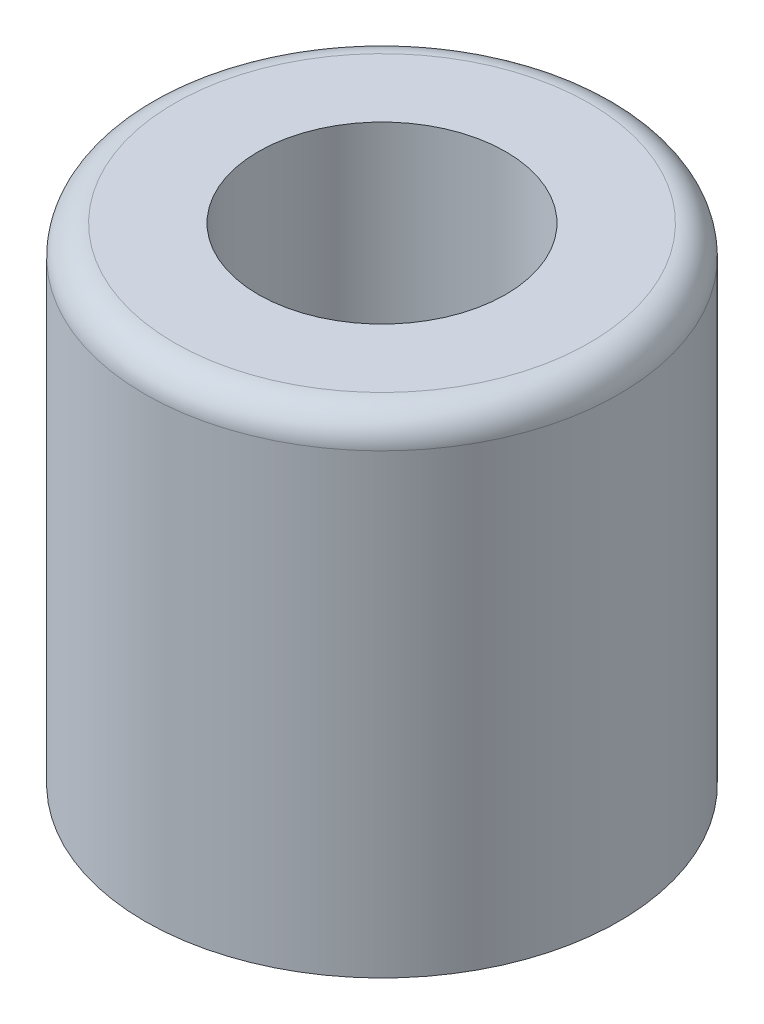
ISO-10303-21;
HEADER;
FILE_DESCRIPTION(('STEP AP214'),'2;1');
FILE_NAME('part.step','',(''),(''),'','','');
FILE_SCHEMA(('AUTOMOTIVE_DESIGN { 1 0 10303 214 1 1 1 1 }'));
ENDSEC;
DATA;
#1=APPLICATION_CONTEXT('core data for automotive mechanical design processes');
#2=APPLICATION_PROTOCOL_DEFINITION('international standard','automotive_design',2000,#1);
#3=PRODUCT_CONTEXT('',#1,'mechanical');
#4=PRODUCT('Part','Part','',(#3));
#5=PRODUCT_RELATED_PRODUCT_CATEGORY('part','',(#4));
#6=PRODUCT_DEFINITION_FORMATION('','',#4);
#7=PRODUCT_DEFINITION_CONTEXT('part definition',#1,'design');
#8=PRODUCT_DEFINITION('design','',#6,#7);
#9=PRODUCT_DEFINITION_SHAPE('','',#8);
#10=(LENGTH_UNIT() NAMED_UNIT(*) SI_UNIT(.MILLI.,.METRE.));
#11=(NAMED_UNIT(*) PLANE_ANGLE_UNIT() SI_UNIT($,.RADIAN.));
#12=(NAMED_UNIT(*) SI_UNIT($,.STERADIAN.) SOLID_ANGLE_UNIT());
#13=UNCERTAINTY_MEASURE_WITH_UNIT(LENGTH_MEASURE(1.E-05),#10,'distance_accuracy_value','');
#14=(GEOMETRIC_REPRESENTATION_CONTEXT(3) GLOBAL_UNCERTAINTY_ASSIGNED_CONTEXT((#13)) GLOBAL_UNIT_ASSIGNED_CONTEXT((#10,
#11,#12)) REPRESENTATION_CONTEXT('',''));
#15=CARTESIAN_POINT('',(0.,0.,0.));
#16=DIRECTION('',(0.,0.,1.));
#17=DIRECTION('',(1.,0.,0.));
#18=AXIS2_PLACEMENT_3D('',#15,#16,#17);
#19=CARTESIAN_POINT('',(0.,4.1656,0.));
#20=DIRECTION('',(0.,1.,0.));
#21=DIRECTION('',(0.,0.,1.));
#22=AXIS2_PLACEMENT_3D('',#19,#20,#21);
#23=PLANE('',#22);
#24=CARTESIAN_POINT('',(0.,4.1656,0.));
#25=DIRECTION('',(0.,-1.,0.));
#26=DIRECTION('',(0.,0.,-1.));
#27=AXIS2_PLACEMENT_3D('',#24,#25,#26);
#28=CIRCLE('',#27,2.1209);
#29=CARTESIAN_POINT('',(0.,4.1656,-2.1209));
#30=VERTEX_POINT('',#29);
#31=EDGE_CURVE('E40',#30,#30,#28,.T.);
#32=ORIENTED_EDGE('',*,*,#31,.T.);
#33=EDGE_LOOP('',(#32));
#34=FACE_BOUND('',#33,.T.);
#35=CARTESIAN_POINT('',(0.,4.1656,0.));
#36=DIRECTION('',(0.,-1.,0.));
#37=DIRECTION('',(0.,0.,-1.));
#38=AXIS2_PLACEMENT_3D('',#35,#36,#37);
#39=CIRCLE('',#38,3.556);
#40=CARTESIAN_POINT('',(0.,4.1656,-3.556));
#41=VERTEX_POINT('',#40);
#42=CARTESIAN_POINT('',(0.,4.1656,3.556));
#43=VERTEX_POINT('',#42);
#44=EDGE_CURVE('E34',#41,#43,#39,.T.);
#45=ORIENTED_EDGE('',*,*,#44,.F.);
#46=CARTESIAN_POINT('',(0.,4.1656,0.));
#47=DIRECTION('',(0.,-1.,0.));
#48=DIRECTION('',(0.,0.,1.));
#49=AXIS2_PLACEMENT_3D('',#46,#47,#48);
#50=CIRCLE('',#49,3.556);
#51=EDGE_CURVE('E38',#43,#41,#50,.T.);
#52=ORIENTED_EDGE('',*,*,#51,.F.);
#53=EDGE_LOOP('',(#45,#52));
#54=FACE_BOUND('',#53,.T.);
#55=ADVANCED_FACE('F16',(#34,#54),#23,.T.);
#56=CARTESIAN_POINT('',(0.,4.1656,0.));
#57=DIRECTION('',(0.,-1.,0.));
#58=DIRECTION('',(0.,0.,-1.));
#59=AXIS2_PLACEMENT_3D('',#56,#57,#58);
#60=CYLINDRICAL_SURFACE('',#59,2.1209);
#61=CARTESIAN_POINT('',(0.,-4.1656,0.));
#62=DIRECTION('',(0.,-1.,0.));
#63=DIRECTION('',(0.,0.,-1.));
#64=AXIS2_PLACEMENT_3D('',#61,#62,#63);
#65=CIRCLE('',#64,2.1209);
#66=CARTESIAN_POINT('',(0.,-4.1656,-2.1209));
#67=VERTEX_POINT('',#66);
#68=EDGE_CURVE('E45',#67,#67,#65,.T.);
#69=ORIENTED_EDGE('',*,*,#68,.T.);
#70=EDGE_LOOP('',(#69));
#71=FACE_BOUND('',#70,.T.);
#72=ORIENTED_EDGE('',*,*,#31,.F.);
#73=EDGE_LOOP('',(#72));
#74=FACE_BOUND('',#73,.T.);
#75=ADVANCED_FACE('F62',(#71,#74),#60,.F.);
#76=CARTESIAN_POINT('',(0.,3.6576,0.));
#77=DIRECTION('',(0.,1.,0.));
#78=DIRECTION('',(0.,0.,1.));
#79=AXIS2_PLACEMENT_3D('',#76,#77,#78);
#80=TOROIDAL_SURFACE('',#79,3.556,0.508);
#81=CARTESIAN_POINT('',(0.,3.6576,0.));
#82=DIRECTION('',(0.,-1.,0.));
#83=DIRECTION('',(0.,0.,-1.));
#84=AXIS2_PLACEMENT_3D('',#81,#82,#83);
#85=CIRCLE('',#84,4.064);
#86=CARTESIAN_POINT('',(0.,3.6576,-4.064));
#87=VERTEX_POINT('',#86);
#88=EDGE_CURVE('E28',#87,#87,#85,.T.);
#89=ORIENTED_EDGE('',*,*,#88,.F.);
#90=EDGE_LOOP('',(#89));
#91=FACE_BOUND('',#90,.T.);
#92=ORIENTED_EDGE('',*,*,#51,.T.);
#93=ORIENTED_EDGE('',*,*,#44,.T.);
#94=EDGE_LOOP('',(#92,#93));
#95=FACE_BOUND('',#94,.T.);
#96=ADVANCED_FACE('F44',(#91,#95),#80,.T.);
#97=CARTESIAN_POINT('',(0.,-4.1656,0.));
#98=DIRECTION('',(0.,1.,0.));
#99=DIRECTION('',(0.,0.,1.));
#100=AXIS2_PLACEMENT_3D('',#97,#98,#99);
#101=PLANE('',#100);
#102=ORIENTED_EDGE('',*,*,#68,.F.);
#103=EDGE_LOOP('',(#102));
#104=FACE_BOUND('',#103,.T.);
#105=CARTESIAN_POINT('',(0.,-4.1656,0.));
#106=DIRECTION('',(0.,-1.,0.));
#107=DIRECTION('',(0.,0.,-1.));
#108=AXIS2_PLACEMENT_3D('',#105,#106,#107);
#109=CIRCLE('',#108,4.064);
#110=CARTESIAN_POINT('',(0.,-4.1656,-4.064));
#111=VERTEX_POINT('',#110);
#112=EDGE_CURVE('E10',#111,#111,#109,.F.);
#113=ORIENTED_EDGE('',*,*,#112,.F.);
#114=EDGE_LOOP('',(#113));
#115=FACE_BOUND('',#114,.T.);
#116=ADVANCED_FACE('F61',(#104,#115),#101,.F.);
#117=CARTESIAN_POINT('',(0.,4.1656,0.));
#118=DIRECTION('',(0.,-1.,0.));
#119=DIRECTION('',(0.,0.,-1.));
#120=AXIS2_PLACEMENT_3D('',#117,#118,#119);
#121=CYLINDRICAL_SURFACE('',#120,4.064);
#122=ORIENTED_EDGE('',*,*,#88,.T.);
#123=EDGE_LOOP('',(#122));
#124=FACE_BOUND('',#123,.T.);
#125=ORIENTED_EDGE('',*,*,#112,.T.);
#126=EDGE_LOOP('',(#125));
#127=FACE_BOUND('',#126,.T.);
#128=ADVANCED_FACE('F84',(#124,#127),#121,.T.);
#129=CLOSED_SHELL('',(#55,#75,#96,#116,#128));
#130=MANIFOLD_SOLID_BREP('B1',#129);
#131=ADVANCED_BREP_SHAPE_REPRESENTATION('',(#18,#130),#14);
#132=SHAPE_DEFINITION_REPRESENTATION(#9,#131);
ENDSEC;
END-ISO-10303-21;
